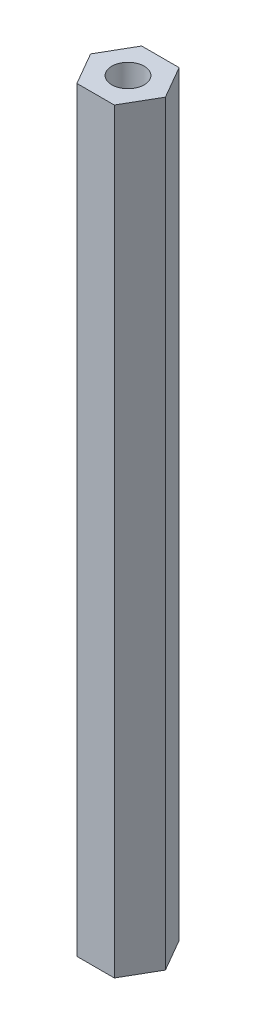
ISO-10303-21;
HEADER;
FILE_DESCRIPTION(('STEP AP214'),'2;1');
FILE_NAME('part.step','',(''),(''),'','','');
FILE_SCHEMA(('AUTOMOTIVE_DESIGN { 1 0 10303 214 1 1 1 1 }'));
ENDSEC;
DATA;
#1=APPLICATION_CONTEXT('core data for automotive mechanical design processes');
#2=APPLICATION_PROTOCOL_DEFINITION('international standard','automotive_design',2000,#1);
#3=PRODUCT_CONTEXT('',#1,'mechanical');
#4=PRODUCT('Part','Part','',(#3));
#5=PRODUCT_RELATED_PRODUCT_CATEGORY('part','',(#4));
#6=PRODUCT_DEFINITION_FORMATION('','',#4);
#7=PRODUCT_DEFINITION_CONTEXT('part definition',#1,'design');
#8=PRODUCT_DEFINITION('design','',#6,#7);
#9=PRODUCT_DEFINITION_SHAPE('','',#8);
#10=(LENGTH_UNIT() NAMED_UNIT(*) SI_UNIT(.MILLI.,.METRE.));
#11=(NAMED_UNIT(*) PLANE_ANGLE_UNIT() SI_UNIT($,.RADIAN.));
#12=(NAMED_UNIT(*) SI_UNIT($,.STERADIAN.) SOLID_ANGLE_UNIT());
#13=UNCERTAINTY_MEASURE_WITH_UNIT(LENGTH_MEASURE(1.E-05),#10,'distance_accuracy_value','');
#14=(GEOMETRIC_REPRESENTATION_CONTEXT(3) GLOBAL_UNCERTAINTY_ASSIGNED_CONTEXT((#13)) GLOBAL_UNIT_ASSIGNED_CONTEXT((#10,
#11,#12)) REPRESENTATION_CONTEXT('',''));
#15=CARTESIAN_POINT('',(0.,0.,0.));
#16=DIRECTION('',(0.,0.,1.));
#17=DIRECTION('',(1.,0.,0.));
#18=AXIS2_PLACEMENT_3D('',#15,#16,#17);
#19=CARTESIAN_POINT('',(0.,70.,0.));
#20=DIRECTION('',(0.,1.,0.));
#21=DIRECTION('',(0.,0.,1.));
#22=AXIS2_PLACEMENT_3D('',#19,#20,#21);
#23=PLANE('',#22);
#24=DIRECTION('',(0.5,0.,-0.866025403784439));
#25=VECTOR('',#24,1.);
#26=CARTESIAN_POINT('',(1.73205080756888,70.,3.));
#27=LINE('',#26,#25);
#28=CARTESIAN_POINT('',(1.73205080756888,70.,3.));
#29=VERTEX_POINT('',#28);
#30=CARTESIAN_POINT('',(3.46410161513775,70.,0.));
#31=VERTEX_POINT('',#30);
#32=EDGE_CURVE('E146',#29,#31,#27,.T.);
#33=ORIENTED_EDGE('',*,*,#32,.T.);
#34=DIRECTION('',(-0.5,0.,-0.866025403784439));
#35=VECTOR('',#34,1.);
#36=CARTESIAN_POINT('',(3.46410161513775,70.,0.));
#37=LINE('',#36,#35);
#38=CARTESIAN_POINT('',(1.73205080756888,70.,-3.));
#39=VERTEX_POINT('',#38);
#40=EDGE_CURVE('E93',#31,#39,#37,.T.);
#41=ORIENTED_EDGE('',*,*,#40,.T.);
#42=DIRECTION('',(-1.,0.,0.));
#43=VECTOR('',#42,1.);
#44=CARTESIAN_POINT('',(1.73205080756888,70.,-3.));
#45=LINE('',#44,#43);
#46=CARTESIAN_POINT('',(-1.73205080756888,70.,-3.));
#47=VERTEX_POINT('',#46);
#48=EDGE_CURVE('E106',#39,#47,#45,.T.);
#49=ORIENTED_EDGE('',*,*,#48,.T.);
#50=DIRECTION('',(-0.5,0.,0.866025403784439));
#51=VECTOR('',#50,1.);
#52=CARTESIAN_POINT('',(-1.73205080756888,70.,-3.));
#53=LINE('',#52,#51);
#54=CARTESIAN_POINT('',(-3.46410161513775,70.,0.));
#55=VERTEX_POINT('',#54);
#56=EDGE_CURVE('E100',#47,#55,#53,.T.);
#57=ORIENTED_EDGE('',*,*,#56,.T.);
#58=DIRECTION('',(0.5,0.,0.866025403784438));
#59=VECTOR('',#58,1.);
#60=CARTESIAN_POINT('',(-3.46410161513775,70.,0.));
#61=LINE('',#60,#59);
#62=CARTESIAN_POINT('',(-1.73205080756888,70.,3.));
#63=VERTEX_POINT('',#62);
#64=EDGE_CURVE('E104',#55,#63,#61,.T.);
#65=ORIENTED_EDGE('',*,*,#64,.T.);
#66=DIRECTION('',(1.,0.,0.));
#67=VECTOR('',#66,1.);
#68=CARTESIAN_POINT('',(-1.73205080756888,70.,3.));
#69=LINE('',#68,#67);
#70=EDGE_CURVE('E56',#63,#29,#69,.T.);
#71=ORIENTED_EDGE('',*,*,#70,.T.);
#72=EDGE_LOOP('',(#33,#41,#49,#57,#65,#71));
#73=FACE_BOUND('',#72,.T.);
#74=CARTESIAN_POINT('',(0.,70.,0.));
#75=DIRECTION('',(0.,1.,0.));
#76=DIRECTION('',(0.,0.,1.));
#77=AXIS2_PLACEMENT_3D('',#74,#75,#76);
#78=CIRCLE('',#77,1.5);
#79=CARTESIAN_POINT('',(0.,70.,1.5));
#80=VERTEX_POINT('',#79);
#81=EDGE_CURVE('E135',#80,#80,#78,.T.);
#82=ORIENTED_EDGE('',*,*,#81,.F.);
#83=EDGE_LOOP('',(#82));
#84=FACE_BOUND('',#83,.T.);
#85=ADVANCED_FACE('F38',(#73,#84),#23,.T.);
#86=CARTESIAN_POINT('',(0.,0.,0.));
#87=DIRECTION('',(0.,1.,0.));
#88=DIRECTION('',(0.,0.,1.));
#89=AXIS2_PLACEMENT_3D('',#86,#87,#88);
#90=PLANE('',#89);
#91=DIRECTION('',(0.5,0.,-0.866025403784439));
#92=VECTOR('',#91,1.);
#93=CARTESIAN_POINT('',(1.73205080756888,0.,3.));
#94=LINE('',#93,#92);
#95=CARTESIAN_POINT('',(1.73205080756888,0.,3.));
#96=VERTEX_POINT('',#95);
#97=CARTESIAN_POINT('',(3.46410161513775,0.,0.));
#98=VERTEX_POINT('',#97);
#99=EDGE_CURVE('E130',#96,#98,#94,.T.);
#100=ORIENTED_EDGE('',*,*,#99,.F.);
#101=DIRECTION('',(1.,0.,0.));
#102=VECTOR('',#101,1.);
#103=CARTESIAN_POINT('',(-1.73205080756888,0.,3.));
#104=LINE('',#103,#102);
#105=CARTESIAN_POINT('',(-1.73205080756888,0.,3.));
#106=VERTEX_POINT('',#105);
#107=EDGE_CURVE('E85',#106,#96,#104,.T.);
#108=ORIENTED_EDGE('',*,*,#107,.F.);
#109=DIRECTION('',(0.5,0.,0.866025403784438));
#110=VECTOR('',#109,1.);
#111=CARTESIAN_POINT('',(-3.46410161513775,0.,0.));
#112=LINE('',#111,#110);
#113=CARTESIAN_POINT('',(-3.46410161513775,0.,0.));
#114=VERTEX_POINT('',#113);
#115=EDGE_CURVE('E79',#114,#106,#112,.T.);
#116=ORIENTED_EDGE('',*,*,#115,.F.);
#117=DIRECTION('',(-0.5,0.,0.866025403784439));
#118=VECTOR('',#117,1.);
#119=CARTESIAN_POINT('',(-1.73205080756888,0.,-3.));
#120=LINE('',#119,#118);
#121=CARTESIAN_POINT('',(-1.73205080756888,0.,-3.));
#122=VERTEX_POINT('',#121);
#123=EDGE_CURVE('E115',#122,#114,#120,.T.);
#124=ORIENTED_EDGE('',*,*,#123,.F.);
#125=DIRECTION('',(-1.,0.,0.));
#126=VECTOR('',#125,1.);
#127=CARTESIAN_POINT('',(1.73205080756888,0.,-3.));
#128=LINE('',#127,#126);
#129=CARTESIAN_POINT('',(1.73205080756888,0.,-3.));
#130=VERTEX_POINT('',#129);
#131=EDGE_CURVE('E138',#130,#122,#128,.T.);
#132=ORIENTED_EDGE('',*,*,#131,.F.);
#133=DIRECTION('',(-0.5,0.,-0.866025403784439));
#134=VECTOR('',#133,1.);
#135=CARTESIAN_POINT('',(3.46410161513775,0.,0.));
#136=LINE('',#135,#134);
#137=EDGE_CURVE('E134',#98,#130,#136,.T.);
#138=ORIENTED_EDGE('',*,*,#137,.F.);
#139=EDGE_LOOP('',(#100,#108,#116,#124,#132,#138));
#140=FACE_BOUND('',#139,.T.);
#141=CARTESIAN_POINT('',(0.,0.,0.));
#142=DIRECTION('',(0.,1.,0.));
#143=DIRECTION('',(0.,0.,1.));
#144=AXIS2_PLACEMENT_3D('',#141,#142,#143);
#145=CIRCLE('',#144,1.5);
#146=CARTESIAN_POINT('',(0.,0.,1.5));
#147=VERTEX_POINT('',#146);
#148=EDGE_CURVE('E252',#147,#147,#145,.T.);
#149=ORIENTED_EDGE('',*,*,#148,.T.);
#150=EDGE_LOOP('',(#149));
#151=FACE_BOUND('',#150,.T.);
#152=ADVANCED_FACE('F159',(#140,#151),#90,.F.);
#153=CARTESIAN_POINT('',(1.73205080756888,70.,3.));
#154=DIRECTION('',(-0.866025403784439,0.,-0.5));
#155=DIRECTION('',(-0.5,0.,0.866025403784439));
#156=AXIS2_PLACEMENT_3D('',#153,#154,#155);
#157=PLANE('',#156);
#158=ORIENTED_EDGE('',*,*,#99,.T.);
#159=DIRECTION('',(0.,-1.,0.));
#160=VECTOR('',#159,1.);
#161=CARTESIAN_POINT('',(3.46410161513775,70.,0.));
#162=LINE('',#161,#160);
#163=EDGE_CURVE('E11',#31,#98,#162,.T.);
#164=ORIENTED_EDGE('',*,*,#163,.F.);
#165=ORIENTED_EDGE('',*,*,#32,.F.);
#166=DIRECTION('',(0.,-1.,0.));
#167=VECTOR('',#166,1.);
#168=CARTESIAN_POINT('',(1.73205080756888,70.,3.));
#169=LINE('',#168,#167);
#170=EDGE_CURVE('E126',#29,#96,#169,.T.);
#171=ORIENTED_EDGE('',*,*,#170,.T.);
#172=EDGE_LOOP('',(#158,#164,#165,#171));
#173=FACE_BOUND('',#172,.T.);
#174=ADVANCED_FACE('F40',(#173),#157,.F.);
#175=CARTESIAN_POINT('',(3.46410161513775,70.,0.));
#176=DIRECTION('',(-0.866025403784439,0.,0.5));
#177=DIRECTION('',(0.5,0.,0.866025403784439));
#178=AXIS2_PLACEMENT_3D('',#175,#176,#177);
#179=PLANE('',#178);
#180=ORIENTED_EDGE('',*,*,#137,.T.);
#181=DIRECTION('',(0.,-1.,0.));
#182=VECTOR('',#181,1.);
#183=CARTESIAN_POINT('',(1.73205080756888,70.,-3.));
#184=LINE('',#183,#182);
#185=EDGE_CURVE('E48',#39,#130,#184,.T.);
#186=ORIENTED_EDGE('',*,*,#185,.F.);
#187=ORIENTED_EDGE('',*,*,#40,.F.);
#188=ORIENTED_EDGE('',*,*,#163,.T.);
#189=EDGE_LOOP('',(#180,#186,#187,#188));
#190=FACE_BOUND('',#189,.T.);
#191=ADVANCED_FACE('F184',(#190),#179,.F.);
#192=CARTESIAN_POINT('',(1.73205080756888,70.,-3.));
#193=DIRECTION('',(0.,0.,1.));
#194=DIRECTION('',(1.,0.,0.));
#195=AXIS2_PLACEMENT_3D('',#192,#193,#194);
#196=PLANE('',#195);
#197=ORIENTED_EDGE('',*,*,#131,.T.);
#198=DIRECTION('',(0.,-1.,0.));
#199=VECTOR('',#198,1.);
#200=CARTESIAN_POINT('',(-1.73205080756888,70.,-3.));
#201=LINE('',#200,#199);
#202=EDGE_CURVE('E117',#47,#122,#201,.T.);
#203=ORIENTED_EDGE('',*,*,#202,.F.);
#204=ORIENTED_EDGE('',*,*,#48,.F.);
#205=ORIENTED_EDGE('',*,*,#185,.T.);
#206=EDGE_LOOP('',(#197,#203,#204,#205));
#207=FACE_BOUND('',#206,.T.);
#208=ADVANCED_FACE('F156',(#207),#196,.F.);
#209=CARTESIAN_POINT('',(-1.73205080756888,70.,-3.));
#210=DIRECTION('',(0.866025403784439,0.,0.5));
#211=DIRECTION('',(0.5,0.,-0.866025403784439));
#212=AXIS2_PLACEMENT_3D('',#209,#210,#211);
#213=PLANE('',#212);
#214=ORIENTED_EDGE('',*,*,#123,.T.);
#215=DIRECTION('',(0.,-1.,0.));
#216=VECTOR('',#215,1.);
#217=CARTESIAN_POINT('',(-3.46410161513775,70.,0.));
#218=LINE('',#217,#216);
#219=EDGE_CURVE('E112',#55,#114,#218,.T.);
#220=ORIENTED_EDGE('',*,*,#219,.F.);
#221=ORIENTED_EDGE('',*,*,#56,.F.);
#222=ORIENTED_EDGE('',*,*,#202,.T.);
#223=EDGE_LOOP('',(#214,#220,#221,#222));
#224=FACE_BOUND('',#223,.T.);
#225=ADVANCED_FACE('F113',(#224),#213,.F.);
#226=CARTESIAN_POINT('',(-3.46410161513775,70.,0.));
#227=DIRECTION('',(0.866025403784438,0.,-0.5));
#228=DIRECTION('',(-0.5,0.,-0.866025403784438));
#229=AXIS2_PLACEMENT_3D('',#226,#227,#228);
#230=PLANE('',#229);
#231=ORIENTED_EDGE('',*,*,#115,.T.);
#232=DIRECTION('',(0.,-1.,0.));
#233=VECTOR('',#232,1.);
#234=CARTESIAN_POINT('',(-1.73205080756888,70.,3.));
#235=LINE('',#234,#233);
#236=EDGE_CURVE('E118',#63,#106,#235,.T.);
#237=ORIENTED_EDGE('',*,*,#236,.F.);
#238=ORIENTED_EDGE('',*,*,#64,.F.);
#239=ORIENTED_EDGE('',*,*,#219,.T.);
#240=EDGE_LOOP('',(#231,#237,#238,#239));
#241=FACE_BOUND('',#240,.T.);
#242=ADVANCED_FACE('F120',(#241),#230,.F.);
#243=CARTESIAN_POINT('',(-1.73205080756888,70.,3.));
#244=DIRECTION('',(0.,0.,-1.));
#245=DIRECTION('',(-1.,0.,0.));
#246=AXIS2_PLACEMENT_3D('',#243,#244,#245);
#247=PLANE('',#246);
#248=ORIENTED_EDGE('',*,*,#107,.T.);
#249=ORIENTED_EDGE('',*,*,#170,.F.);
#250=ORIENTED_EDGE('',*,*,#70,.F.);
#251=ORIENTED_EDGE('',*,*,#236,.T.);
#252=EDGE_LOOP('',(#248,#249,#250,#251));
#253=FACE_BOUND('',#252,.T.);
#254=ADVANCED_FACE('F164',(#253),#247,.F.);
#255=CARTESIAN_POINT('',(0.,70.,0.));
#256=DIRECTION('',(0.,-1.,0.));
#257=DIRECTION('',(0.,0.,-1.));
#258=AXIS2_PLACEMENT_3D('',#255,#256,#257);
#259=CYLINDRICAL_SURFACE('',#258,1.5);
#260=ORIENTED_EDGE('',*,*,#81,.T.);
#261=EDGE_LOOP('',(#260));
#262=FACE_BOUND('',#261,.T.);
#263=ORIENTED_EDGE('',*,*,#148,.F.);
#264=EDGE_LOOP('',(#263));
#265=FACE_BOUND('',#264,.T.);
#266=ADVANCED_FACE('F166',(#262,#265),#259,.F.);
#267=CLOSED_SHELL('',(#85,#152,#174,#191,#208,#225,#242,#254,#266));
#268=MANIFOLD_SOLID_BREP('B2',#267);
#269=ADVANCED_BREP_SHAPE_REPRESENTATION('',(#18,#268),#14);
#270=SHAPE_DEFINITION_REPRESENTATION(#9,#269);
ENDSEC;
END-ISO-10303-21;
